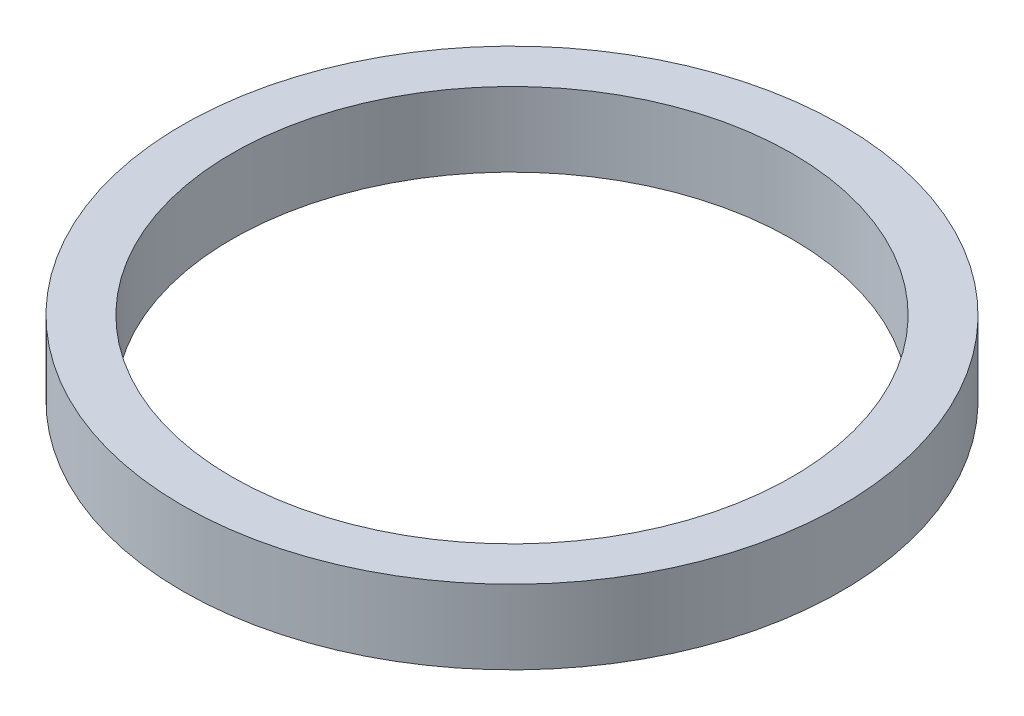
ISO-10303-21;
HEADER;
FILE_DESCRIPTION(('STEP AP214'),'2;1');
FILE_NAME('part.step','',(''),(''),'','','');
FILE_SCHEMA(('AUTOMOTIVE_DESIGN { 1 0 10303 214 1 1 1 1 }'));
ENDSEC;
DATA;
#1=APPLICATION_CONTEXT('core data for automotive mechanical design processes');
#2=APPLICATION_PROTOCOL_DEFINITION('international standard','automotive_design',2000,#1);
#3=PRODUCT_CONTEXT('',#1,'mechanical');
#4=PRODUCT('Part','Part','',(#3));
#5=PRODUCT_RELATED_PRODUCT_CATEGORY('part','',(#4));
#6=PRODUCT_DEFINITION_FORMATION('','',#4);
#7=PRODUCT_DEFINITION_CONTEXT('part definition',#1,'design');
#8=PRODUCT_DEFINITION('design','',#6,#7);
#9=PRODUCT_DEFINITION_SHAPE('','',#8);
#10=(LENGTH_UNIT() NAMED_UNIT(*) SI_UNIT(.MILLI.,.METRE.));
#11=(NAMED_UNIT(*) PLANE_ANGLE_UNIT() SI_UNIT($,.RADIAN.));
#12=(NAMED_UNIT(*) SI_UNIT($,.STERADIAN.) SOLID_ANGLE_UNIT());
#13=UNCERTAINTY_MEASURE_WITH_UNIT(LENGTH_MEASURE(1.E-05),#10,'distance_accuracy_value','');
#14=(GEOMETRIC_REPRESENTATION_CONTEXT(3) GLOBAL_UNCERTAINTY_ASSIGNED_CONTEXT((#13)) GLOBAL_UNIT_ASSIGNED_CONTEXT((#10,
#11,#12)) REPRESENTATION_CONTEXT('',''));
#15=CARTESIAN_POINT('',(0.,0.,0.));
#16=DIRECTION('',(0.,0.,1.));
#17=DIRECTION('',(1.,0.,0.));
#18=AXIS2_PLACEMENT_3D('',#15,#16,#17);
#19=CARTESIAN_POINT('',(0.,5.715,0.));
#20=DIRECTION('',(0.,1.,0.));
#21=DIRECTION('',(0.,0.,1.));
#22=AXIS2_PLACEMENT_3D('',#19,#20,#21);
#23=PLANE('',#22);
#24=CARTESIAN_POINT('',(0.,5.715,0.));
#25=DIRECTION('',(0.,1.,0.));
#26=DIRECTION('',(0.,0.,1.));
#27=AXIS2_PLACEMENT_3D('',#24,#25,#26);
#28=CIRCLE('',#27,25.4);
#29=CARTESIAN_POINT('',(0.,5.715,25.4));
#30=VERTEX_POINT('',#29);
#31=EDGE_CURVE('E10',#30,#30,#28,.T.);
#32=ORIENTED_EDGE('',*,*,#31,.T.);
#33=EDGE_LOOP('',(#32));
#34=FACE_BOUND('',#33,.T.);
#35=CARTESIAN_POINT('',(0.,5.715,0.));
#36=DIRECTION('',(0.,1.,0.));
#37=DIRECTION('',(0.,0.,1.));
#38=AXIS2_PLACEMENT_3D('',#35,#36,#37);
#39=CIRCLE('',#38,21.59);
#40=CARTESIAN_POINT('',(0.,5.715,21.59));
#41=VERTEX_POINT('',#40);
#42=EDGE_CURVE('E41',#41,#41,#39,.T.);
#43=ORIENTED_EDGE('',*,*,#42,.F.);
#44=EDGE_LOOP('',(#43));
#45=FACE_BOUND('',#44,.T.);
#46=ADVANCED_FACE('F30',(#34,#45),#23,.T.);
#47=CARTESIAN_POINT('',(0.,0.,0.));
#48=DIRECTION('',(0.,1.,0.));
#49=DIRECTION('',(0.,0.,1.));
#50=AXIS2_PLACEMENT_3D('',#47,#48,#49);
#51=PLANE('',#50);
#52=CARTESIAN_POINT('',(0.,0.,0.));
#53=DIRECTION('',(0.,1.,0.));
#54=DIRECTION('',(0.,0.,1.));
#55=AXIS2_PLACEMENT_3D('',#52,#53,#54);
#56=CIRCLE('',#55,25.4);
#57=CARTESIAN_POINT('',(0.,0.,25.4));
#58=VERTEX_POINT('',#57);
#59=EDGE_CURVE('E34',#58,#58,#56,.T.);
#60=ORIENTED_EDGE('',*,*,#59,.F.);
#61=EDGE_LOOP('',(#60));
#62=FACE_BOUND('',#61,.T.);
#63=CARTESIAN_POINT('',(0.,0.,0.));
#64=DIRECTION('',(0.,1.,0.));
#65=DIRECTION('',(0.,0.,1.));
#66=AXIS2_PLACEMENT_3D('',#63,#64,#65);
#67=CIRCLE('',#66,21.59);
#68=CARTESIAN_POINT('',(0.,0.,21.59));
#69=VERTEX_POINT('',#68);
#70=EDGE_CURVE('E43',#69,#69,#67,.T.);
#71=ORIENTED_EDGE('',*,*,#70,.T.);
#72=EDGE_LOOP('',(#71));
#73=FACE_BOUND('',#72,.T.);
#74=ADVANCED_FACE('F53',(#62,#73),#51,.F.);
#75=CARTESIAN_POINT('',(0.,5.715,0.));
#76=DIRECTION('',(0.,-1.,0.));
#77=DIRECTION('',(0.,0.,-1.));
#78=AXIS2_PLACEMENT_3D('',#75,#76,#77);
#79=CYLINDRICAL_SURFACE('',#78,25.4);
#80=ORIENTED_EDGE('',*,*,#31,.F.);
#81=EDGE_LOOP('',(#80));
#82=FACE_BOUND('',#81,.T.);
#83=ORIENTED_EDGE('',*,*,#59,.T.);
#84=EDGE_LOOP('',(#83));
#85=FACE_BOUND('',#84,.T.);
#86=ADVANCED_FACE('F32',(#82,#85),#79,.T.);
#87=CARTESIAN_POINT('',(0.,5.715,0.));
#88=DIRECTION('',(0.,-1.,0.));
#89=DIRECTION('',(0.,0.,-1.));
#90=AXIS2_PLACEMENT_3D('',#87,#88,#89);
#91=CYLINDRICAL_SURFACE('',#90,21.59);
#92=ORIENTED_EDGE('',*,*,#42,.T.);
#93=EDGE_LOOP('',(#92));
#94=FACE_BOUND('',#93,.T.);
#95=ORIENTED_EDGE('',*,*,#70,.F.);
#96=EDGE_LOOP('',(#95));
#97=FACE_BOUND('',#96,.T.);
#98=ADVANCED_FACE('F49',(#94,#97),#91,.F.);
#99=CLOSED_SHELL('',(#46,#74,#86,#98));
#100=MANIFOLD_SOLID_BREP('B2',#99);
#101=ADVANCED_BREP_SHAPE_REPRESENTATION('',(#18,#100),#14);
#102=SHAPE_DEFINITION_REPRESENTATION(#9,#101);
ENDSEC;
END-ISO-10303-21;
